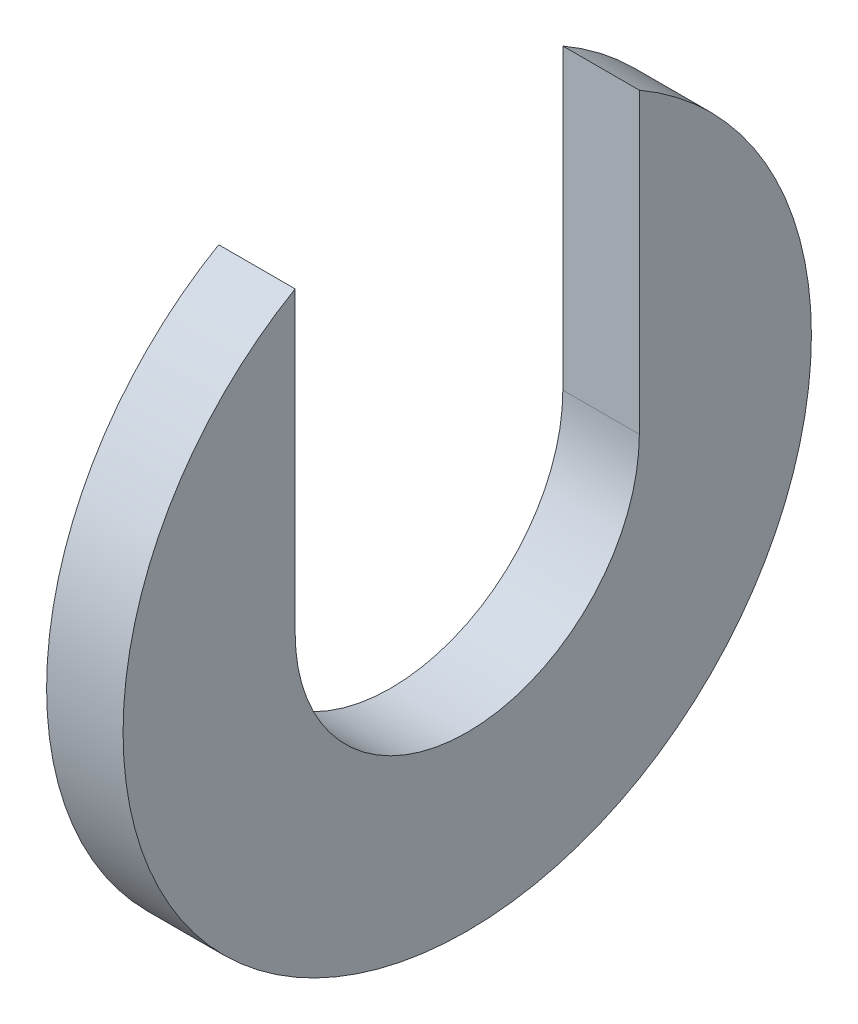
ISO-10303-21;
HEADER;
FILE_DESCRIPTION(('STEP AP214'),'2;1');
FILE_NAME('part.step','',(''),(''),'','','');
FILE_SCHEMA(('AUTOMOTIVE_DESIGN { 1 0 10303 214 1 1 1 1 }'));
ENDSEC;
DATA;
#1=APPLICATION_CONTEXT('core data for automotive mechanical design processes');
#2=APPLICATION_PROTOCOL_DEFINITION('international standard','automotive_design',2000,#1);
#3=PRODUCT_CONTEXT('',#1,'mechanical');
#4=PRODUCT('Part','Part','',(#3));
#5=PRODUCT_RELATED_PRODUCT_CATEGORY('part','',(#4));
#6=PRODUCT_DEFINITION_FORMATION('','',#4);
#7=PRODUCT_DEFINITION_CONTEXT('part definition',#1,'design');
#8=PRODUCT_DEFINITION('design','',#6,#7);
#9=PRODUCT_DEFINITION_SHAPE('','',#8);
#10=(LENGTH_UNIT() NAMED_UNIT(*) SI_UNIT(.MILLI.,.METRE.));
#11=(NAMED_UNIT(*) PLANE_ANGLE_UNIT() SI_UNIT($,.RADIAN.));
#12=(NAMED_UNIT(*) SI_UNIT($,.STERADIAN.) SOLID_ANGLE_UNIT());
#13=UNCERTAINTY_MEASURE_WITH_UNIT(LENGTH_MEASURE(1.E-05),#10,'distance_accuracy_value','');
#14=(GEOMETRIC_REPRESENTATION_CONTEXT(3) GLOBAL_UNCERTAINTY_ASSIGNED_CONTEXT((#13)) GLOBAL_UNIT_ASSIGNED_CONTEXT((#10,
#11,#12)) REPRESENTATION_CONTEXT('',''));
#15=CARTESIAN_POINT('',(0.,0.,0.));
#16=DIRECTION('',(0.,0.,1.));
#17=DIRECTION('',(1.,0.,0.));
#18=AXIS2_PLACEMENT_3D('',#15,#16,#17);
#19=CARTESIAN_POINT('',(1.,0.,0.));
#20=DIRECTION('',(-1.,0.,0.));
#21=DIRECTION('',(0.,0.,1.));
#22=AXIS2_PLACEMENT_3D('',#19,#20,#21);
#23=CYLINDRICAL_SURFACE('',#22,9.);
#24=DIRECTION('',(-1.,0.,0.));
#25=VECTOR('',#24,1.);
#26=CARTESIAN_POINT('',(1.,7.79422863405995,4.5));
#27=LINE('',#26,#25);
#28=CARTESIAN_POINT('',(-1.,7.79422863405995,4.5));
#29=VERTEX_POINT('',#28);
#30=CARTESIAN_POINT('',(1.,7.79422863405995,4.5));
#31=VERTEX_POINT('',#30);
#32=EDGE_CURVE('E76',#29,#31,#27,.F.);
#33=ORIENTED_EDGE('',*,*,#32,.F.);
#34=CARTESIAN_POINT('',(-1.,0.,0.));
#35=DIRECTION('',(1.,0.,0.));
#36=DIRECTION('',(0.,0.,-1.));
#37=AXIS2_PLACEMENT_3D('',#34,#35,#36);
#38=CIRCLE('',#37,9.);
#39=CARTESIAN_POINT('',(-1.,7.79422863405995,-4.5));
#40=VERTEX_POINT('',#39);
#41=EDGE_CURVE('E100',#29,#40,#38,.T.);
#42=ORIENTED_EDGE('',*,*,#41,.T.);
#43=DIRECTION('',(-1.,0.,0.));
#44=VECTOR('',#43,1.);
#45=CARTESIAN_POINT('',(1.,7.79422863405995,-4.5));
#46=LINE('',#45,#44);
#47=CARTESIAN_POINT('',(1.,7.79422863405995,-4.5));
#48=VERTEX_POINT('',#47);
#49=EDGE_CURVE('E57',#40,#48,#46,.F.);
#50=ORIENTED_EDGE('',*,*,#49,.T.);
#51=CARTESIAN_POINT('',(1.,0.,0.));
#52=DIRECTION('',(1.,0.,0.));
#53=DIRECTION('',(0.,0.,-1.));
#54=AXIS2_PLACEMENT_3D('',#51,#52,#53);
#55=CIRCLE('',#54,9.);
#56=EDGE_CURVE('E95',#31,#48,#55,.T.);
#57=ORIENTED_EDGE('',*,*,#56,.F.);
#58=EDGE_LOOP('',(#33,#42,#50,#57));
#59=FACE_BOUND('',#58,.T.);
#60=ADVANCED_FACE('F36',(#59),#23,.T.);
#61=CARTESIAN_POINT('',(1.,0.,0.));
#62=DIRECTION('',(1.,0.,0.));
#63=DIRECTION('',(0.,0.,-1.));
#64=AXIS2_PLACEMENT_3D('',#61,#62,#63);
#65=PLANE('',#64);
#66=CARTESIAN_POINT('',(1.,0.,0.));
#67=DIRECTION('',(1.,0.,0.));
#68=DIRECTION('',(0.,0.,-1.));
#69=AXIS2_PLACEMENT_3D('',#66,#67,#68);
#70=CIRCLE('',#69,4.5);
#71=CARTESIAN_POINT('',(1.,0.,4.5));
#72=VERTEX_POINT('',#71);
#73=CARTESIAN_POINT('',(1.,0.,-4.5));
#74=VERTEX_POINT('',#73);
#75=EDGE_CURVE('E88',#72,#74,#70,.T.);
#76=ORIENTED_EDGE('',*,*,#75,.F.);
#77=DIRECTION('',(0.,-1.,0.));
#78=VECTOR('',#77,1.);
#79=CARTESIAN_POINT('',(1.,9.,4.5));
#80=LINE('',#79,#78);
#81=EDGE_CURVE('E73',#31,#72,#80,.T.);
#82=ORIENTED_EDGE('',*,*,#81,.F.);
#83=ORIENTED_EDGE('',*,*,#56,.T.);
#84=DIRECTION('',(0.,-1.,0.));
#85=VECTOR('',#84,1.);
#86=CARTESIAN_POINT('',(1.,9.,-4.5));
#87=LINE('',#86,#85);
#88=EDGE_CURVE('E81',#48,#74,#87,.T.);
#89=ORIENTED_EDGE('',*,*,#88,.T.);
#90=EDGE_LOOP('',(#76,#82,#83,#89));
#91=FACE_BOUND('',#90,.T.);
#92=ADVANCED_FACE('F94',(#91),#65,.T.);
#93=CARTESIAN_POINT('',(-1.,0.,0.));
#94=DIRECTION('',(1.,0.,0.));
#95=DIRECTION('',(0.,0.,-1.));
#96=AXIS2_PLACEMENT_3D('',#93,#94,#95);
#97=PLANE('',#96);
#98=DIRECTION('',(0.,1.,0.));
#99=VECTOR('',#98,1.);
#100=CARTESIAN_POINT('',(-1.,0.,4.5));
#101=LINE('',#100,#99);
#102=CARTESIAN_POINT('',(-1.,0.,4.5));
#103=VERTEX_POINT('',#102);
#104=EDGE_CURVE('E11',#103,#29,#101,.T.);
#105=ORIENTED_EDGE('',*,*,#104,.F.);
#106=CARTESIAN_POINT('',(-1.,0.,0.));
#107=DIRECTION('',(1.,0.,0.));
#108=DIRECTION('',(0.,0.,-1.));
#109=AXIS2_PLACEMENT_3D('',#106,#107,#108);
#110=CIRCLE('',#109,4.5);
#111=CARTESIAN_POINT('',(-1.,0.,-4.5));
#112=VERTEX_POINT('',#111);
#113=EDGE_CURVE('E90',#103,#112,#110,.T.);
#114=ORIENTED_EDGE('',*,*,#113,.T.);
#115=DIRECTION('',(0.,1.,0.));
#116=VECTOR('',#115,1.);
#117=CARTESIAN_POINT('',(-1.,0.,-4.5));
#118=LINE('',#117,#116);
#119=EDGE_CURVE('E43',#112,#40,#118,.T.);
#120=ORIENTED_EDGE('',*,*,#119,.T.);
#121=ORIENTED_EDGE('',*,*,#41,.F.);
#122=EDGE_LOOP('',(#105,#114,#120,#121));
#123=FACE_BOUND('',#122,.T.);
#124=ADVANCED_FACE('F104',(#123),#97,.F.);
#125=CARTESIAN_POINT('',(1.,0.,0.));
#126=DIRECTION('',(-1.,0.,0.));
#127=DIRECTION('',(0.,0.,1.));
#128=AXIS2_PLACEMENT_3D('',#125,#126,#127);
#129=CYLINDRICAL_SURFACE('',#128,4.5);
#130=DIRECTION('',(1.,0.,0.));
#131=VECTOR('',#130,1.);
#132=CARTESIAN_POINT('',(-1.,0.,4.5));
#133=LINE('',#132,#131);
#134=EDGE_CURVE('E49',#103,#72,#133,.T.);
#135=ORIENTED_EDGE('',*,*,#134,.T.);
#136=ORIENTED_EDGE('',*,*,#75,.T.);
#137=DIRECTION('',(1.,0.,0.));
#138=VECTOR('',#137,1.);
#139=CARTESIAN_POINT('',(-1.,0.,-4.5));
#140=LINE('',#139,#138);
#141=EDGE_CURVE('E91',#112,#74,#140,.T.);
#142=ORIENTED_EDGE('',*,*,#141,.F.);
#143=ORIENTED_EDGE('',*,*,#113,.F.);
#144=EDGE_LOOP('',(#135,#136,#142,#143));
#145=FACE_BOUND('',#144,.T.);
#146=ADVANCED_FACE('F86',(#145),#129,.F.);
#147=CARTESIAN_POINT('',(-1.,9.,-4.5));
#148=DIRECTION('',(0.,0.,-1.));
#149=DIRECTION('',(-1.,0.,0.));
#150=AXIS2_PLACEMENT_3D('',#147,#148,#149);
#151=PLANE('',#150);
#152=ORIENTED_EDGE('',*,*,#119,.F.);
#153=ORIENTED_EDGE('',*,*,#141,.T.);
#154=ORIENTED_EDGE('',*,*,#88,.F.);
#155=ORIENTED_EDGE('',*,*,#49,.F.);
#156=EDGE_LOOP('',(#152,#153,#154,#155));
#157=FACE_BOUND('',#156,.T.);
#158=ADVANCED_FACE('F110',(#157),#151,.F.);
#159=CARTESIAN_POINT('',(-1.,9.,4.5));
#160=DIRECTION('',(0.,0.,-1.));
#161=DIRECTION('',(-1.,0.,0.));
#162=AXIS2_PLACEMENT_3D('',#159,#160,#161);
#163=PLANE('',#162);
#164=ORIENTED_EDGE('',*,*,#32,.T.);
#165=ORIENTED_EDGE('',*,*,#81,.T.);
#166=ORIENTED_EDGE('',*,*,#134,.F.);
#167=ORIENTED_EDGE('',*,*,#104,.T.);
#168=EDGE_LOOP('',(#164,#165,#166,#167));
#169=FACE_BOUND('',#168,.T.);
#170=ADVANCED_FACE('F74',(#169),#163,.T.);
#171=CLOSED_SHELL('',(#60,#92,#124,#146,#158,#170));
#172=MANIFOLD_SOLID_BREP('B2',#171);
#173=ADVANCED_BREP_SHAPE_REPRESENTATION('',(#18,#172),#14);
#174=SHAPE_DEFINITION_REPRESENTATION(#9,#173);
ENDSEC;
END-ISO-10303-21;
